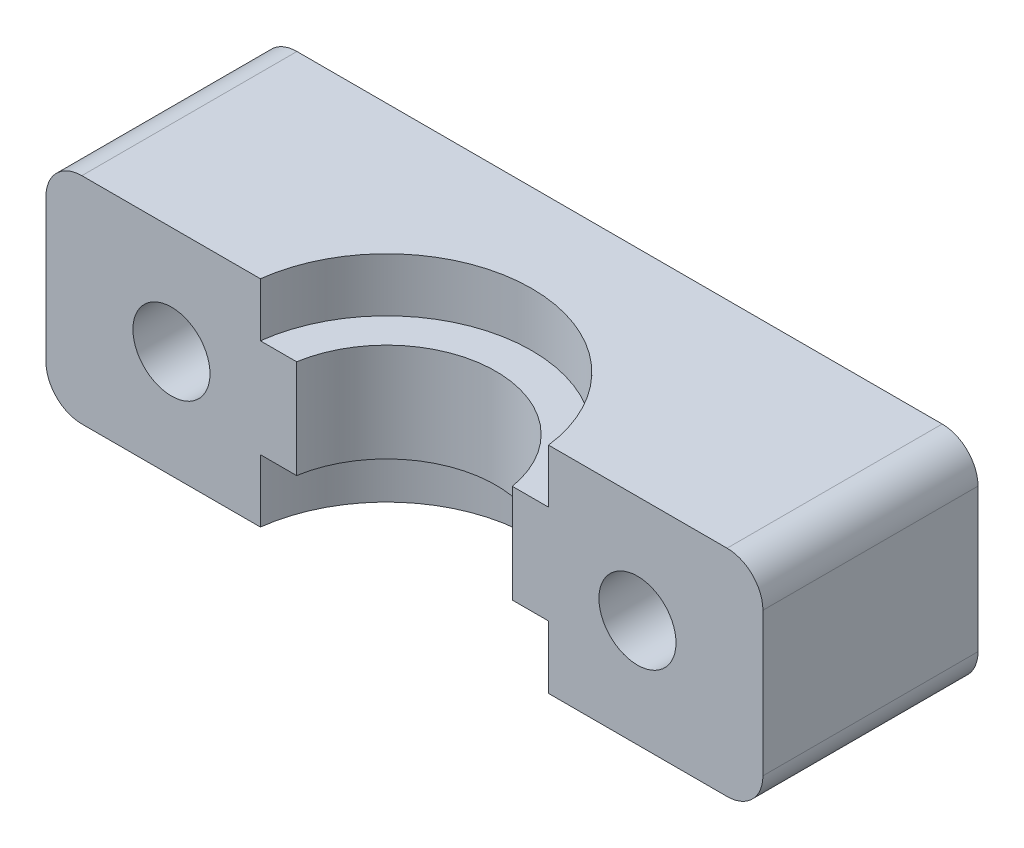
ISO-10303-21;
HEADER;
FILE_DESCRIPTION(('STEP AP214'),'2;1');
FILE_NAME('part.step','',(''),(''),'','','');
FILE_SCHEMA(('AUTOMOTIVE_DESIGN { 1 0 10303 214 1 1 1 1 }'));
ENDSEC;
DATA;
#1=APPLICATION_CONTEXT('core data for automotive mechanical design processes');
#2=APPLICATION_PROTOCOL_DEFINITION('international standard','automotive_design',2000,#1);
#3=PRODUCT_CONTEXT('',#1,'mechanical');
#4=PRODUCT('Part','Part','',(#3));
#5=PRODUCT_RELATED_PRODUCT_CATEGORY('part','',(#4));
#6=PRODUCT_DEFINITION_FORMATION('','',#4);
#7=PRODUCT_DEFINITION_CONTEXT('part definition',#1,'design');
#8=PRODUCT_DEFINITION('design','',#6,#7);
#9=PRODUCT_DEFINITION_SHAPE('','',#8);
#10=(LENGTH_UNIT() NAMED_UNIT(*) SI_UNIT(.MILLI.,.METRE.));
#11=(NAMED_UNIT(*) PLANE_ANGLE_UNIT() SI_UNIT($,.RADIAN.));
#12=(NAMED_UNIT(*) SI_UNIT($,.STERADIAN.) SOLID_ANGLE_UNIT());
#13=UNCERTAINTY_MEASURE_WITH_UNIT(LENGTH_MEASURE(1.E-05),#10,'distance_accuracy_value','');
#14=(GEOMETRIC_REPRESENTATION_CONTEXT(3) GLOBAL_UNCERTAINTY_ASSIGNED_CONTEXT((#13)) GLOBAL_UNIT_ASSIGNED_CONTEXT((#10,
#11,#12)) REPRESENTATION_CONTEXT('',''));
#15=CARTESIAN_POINT('',(0.,0.,0.));
#16=DIRECTION('',(0.,0.,1.));
#17=DIRECTION('',(1.,0.,0.));
#18=AXIS2_PLACEMENT_3D('',#15,#16,#17);
#19=CARTESIAN_POINT('',(13.,0.,12.));
#20=DIRECTION('',(0.,0.,1.));
#21=DIRECTION('',(-1.,0.,0.));
#22=AXIS2_PLACEMENT_3D('',#19,#20,#21);
#23=CYLINDRICAL_SURFACE('',#22,2.15);
#24=CARTESIAN_POINT('',(13.,0.,12.));
#25=DIRECTION('',(0.,0.,1.));
#26=DIRECTION('',(1.,0.,0.));
#27=AXIS2_PLACEMENT_3D('',#24,#25,#26);
#28=CIRCLE('',#27,2.15);
#29=CARTESIAN_POINT('',(15.15,0.,12.));
#30=VERTEX_POINT('',#29);
#31=EDGE_CURVE('E11',#30,#30,#28,.T.);
#32=ORIENTED_EDGE('',*,*,#31,.T.);
#33=EDGE_LOOP('',(#32));
#34=FACE_BOUND('',#33,.T.);
#35=CARTESIAN_POINT('',(13.,0.,5.2));
#36=DIRECTION('',(0.,0.,-1.));
#37=DIRECTION('',(-1.,0.,0.));
#38=AXIS2_PLACEMENT_3D('',#35,#36,#37);
#39=CIRCLE('',#38,2.15);
#40=CARTESIAN_POINT('',(10.85,0.,5.2));
#41=VERTEX_POINT('',#40);
#42=EDGE_CURVE('E277',#41,#41,#39,.T.);
#43=ORIENTED_EDGE('',*,*,#42,.T.);
#44=EDGE_LOOP('',(#43));
#45=FACE_BOUND('',#44,.T.);
#46=ADVANCED_FACE('F36',(#34,#45),#23,.F.);
#47=CARTESIAN_POINT('',(-13.,0.,12.));
#48=DIRECTION('',(0.,0.,1.));
#49=DIRECTION('',(-1.,0.,0.));
#50=AXIS2_PLACEMENT_3D('',#47,#48,#49);
#51=CYLINDRICAL_SURFACE('',#50,2.15);
#52=CARTESIAN_POINT('',(-13.,0.,12.));
#53=DIRECTION('',(0.,0.,1.));
#54=DIRECTION('',(1.,0.,0.));
#55=AXIS2_PLACEMENT_3D('',#52,#53,#54);
#56=CIRCLE('',#55,2.15);
#57=CARTESIAN_POINT('',(-10.85,0.,12.));
#58=VERTEX_POINT('',#57);
#59=EDGE_CURVE('E46',#58,#58,#56,.T.);
#60=ORIENTED_EDGE('',*,*,#59,.T.);
#61=EDGE_LOOP('',(#60));
#62=FACE_BOUND('',#61,.T.);
#63=CARTESIAN_POINT('',(-13.,0.,5.2));
#64=DIRECTION('',(0.,0.,-1.));
#65=DIRECTION('',(-1.,0.,0.));
#66=AXIS2_PLACEMENT_3D('',#63,#64,#65);
#67=CIRCLE('',#66,2.15);
#68=CARTESIAN_POINT('',(-15.15,0.,5.2));
#69=VERTEX_POINT('',#68);
#70=EDGE_CURVE('E279',#69,#69,#67,.T.);
#71=ORIENTED_EDGE('',*,*,#70,.T.);
#72=EDGE_LOOP('',(#71));
#73=FACE_BOUND('',#72,.T.);
#74=ADVANCED_FACE('F286',(#62,#73),#51,.F.);
#75=CARTESIAN_POINT('',(-18.,4.,12.));
#76=DIRECTION('',(0.,0.,-1.));
#77=DIRECTION('',(1.,0.,0.));
#78=AXIS2_PLACEMENT_3D('',#75,#76,#77);
#79=CYLINDRICAL_SURFACE('',#78,2.);
#80=CARTESIAN_POINT('',(-18.,4.,12.));
#81=DIRECTION('',(0.,0.,1.));
#82=DIRECTION('',(1.,0.,0.));
#83=AXIS2_PLACEMENT_3D('',#80,#81,#82);
#84=CIRCLE('',#83,2.);
#85=CARTESIAN_POINT('',(-18.,6.,12.));
#86=VERTEX_POINT('',#85);
#87=CARTESIAN_POINT('',(-20.,4.,12.));
#88=VERTEX_POINT('',#87);
#89=EDGE_CURVE('E55',#86,#88,#84,.T.);
#90=ORIENTED_EDGE('',*,*,#89,.F.);
#91=DIRECTION('',(0.,0.,1.));
#92=VECTOR('',#91,1.);
#93=CARTESIAN_POINT('',(-18.,6.,12.));
#94=LINE('',#93,#92);
#95=CARTESIAN_POINT('',(-18.,6.,0.));
#96=VERTEX_POINT('',#95);
#97=EDGE_CURVE('E156',#96,#86,#94,.T.);
#98=ORIENTED_EDGE('',*,*,#97,.F.);
#99=CARTESIAN_POINT('',(-18.,4.,0.));
#100=DIRECTION('',(0.,0.,-1.));
#101=DIRECTION('',(1.,0.,0.));
#102=AXIS2_PLACEMENT_3D('',#99,#100,#101);
#103=CIRCLE('',#102,2.);
#104=CARTESIAN_POINT('',(-20.,4.,0.));
#105=VERTEX_POINT('',#104);
#106=EDGE_CURVE('E163',#105,#96,#103,.T.);
#107=ORIENTED_EDGE('',*,*,#106,.F.);
#108=DIRECTION('',(0.,0.,-1.));
#109=VECTOR('',#108,1.);
#110=CARTESIAN_POINT('',(-20.,4.,0.));
#111=LINE('',#110,#109);
#112=EDGE_CURVE('E169',#88,#105,#111,.T.);
#113=ORIENTED_EDGE('',*,*,#112,.F.);
#114=EDGE_LOOP('',(#90,#98,#107,#113));
#115=FACE_BOUND('',#114,.T.);
#116=ADVANCED_FACE('F313',(#115),#79,.T.);
#117=CARTESIAN_POINT('',(-18.,-4.,12.));
#118=DIRECTION('',(0.,0.,1.));
#119=DIRECTION('',(-1.,0.,0.));
#120=AXIS2_PLACEMENT_3D('',#117,#118,#119);
#121=CYLINDRICAL_SURFACE('',#120,2.);
#122=CARTESIAN_POINT('',(-18.,-4.,12.));
#123=DIRECTION('',(0.,0.,1.));
#124=DIRECTION('',(1.,0.,0.));
#125=AXIS2_PLACEMENT_3D('',#122,#123,#124);
#126=CIRCLE('',#125,2.);
#127=CARTESIAN_POINT('',(-20.,-4.,12.));
#128=VERTEX_POINT('',#127);
#129=CARTESIAN_POINT('',(-18.,-6.,12.));
#130=VERTEX_POINT('',#129);
#131=EDGE_CURVE('E245',#128,#130,#126,.T.);
#132=ORIENTED_EDGE('',*,*,#131,.F.);
#133=DIRECTION('',(0.,0.,1.));
#134=VECTOR('',#133,1.);
#135=CARTESIAN_POINT('',(-20.,-4.,12.));
#136=LINE('',#135,#134);
#137=CARTESIAN_POINT('',(-20.,-4.,0.));
#138=VERTEX_POINT('',#137);
#139=EDGE_CURVE('E176',#138,#128,#136,.T.);
#140=ORIENTED_EDGE('',*,*,#139,.F.);
#141=CARTESIAN_POINT('',(-18.,-4.,0.));
#142=DIRECTION('',(0.,0.,-1.));
#143=DIRECTION('',(1.,0.,0.));
#144=AXIS2_PLACEMENT_3D('',#141,#142,#143);
#145=CIRCLE('',#144,2.);
#146=CARTESIAN_POINT('',(-18.,-6.,0.));
#147=VERTEX_POINT('',#146);
#148=EDGE_CURVE('E164',#147,#138,#145,.T.);
#149=ORIENTED_EDGE('',*,*,#148,.F.);
#150=DIRECTION('',(0.,0.,-1.));
#151=VECTOR('',#150,1.);
#152=CARTESIAN_POINT('',(-18.,-6.,12.));
#153=LINE('',#152,#151);
#154=EDGE_CURVE('E200',#130,#147,#153,.T.);
#155=ORIENTED_EDGE('',*,*,#154,.F.);
#156=EDGE_LOOP('',(#132,#140,#149,#155));
#157=FACE_BOUND('',#156,.T.);
#158=ADVANCED_FACE('F334',(#157),#121,.T.);
#159=CARTESIAN_POINT('',(18.,-4.,12.));
#160=DIRECTION('',(0.,0.,-1.));
#161=DIRECTION('',(1.,0.,0.));
#162=AXIS2_PLACEMENT_3D('',#159,#160,#161);
#163=CYLINDRICAL_SURFACE('',#162,2.);
#164=CARTESIAN_POINT('',(18.,-4.,12.));
#165=DIRECTION('',(0.,0.,1.));
#166=DIRECTION('',(1.,0.,0.));
#167=AXIS2_PLACEMENT_3D('',#164,#165,#166);
#168=CIRCLE('',#167,2.);
#169=CARTESIAN_POINT('',(18.,-6.,12.));
#170=VERTEX_POINT('',#169);
#171=CARTESIAN_POINT('',(20.,-4.,12.));
#172=VERTEX_POINT('',#171);
#173=EDGE_CURVE('E195',#170,#172,#168,.T.);
#174=ORIENTED_EDGE('',*,*,#173,.F.);
#175=DIRECTION('',(0.,0.,1.));
#176=VECTOR('',#175,1.);
#177=CARTESIAN_POINT('',(18.,-6.,12.));
#178=LINE('',#177,#176);
#179=CARTESIAN_POINT('',(18.,-6.,0.));
#180=VERTEX_POINT('',#179);
#181=EDGE_CURVE('E172',#180,#170,#178,.T.);
#182=ORIENTED_EDGE('',*,*,#181,.F.);
#183=CARTESIAN_POINT('',(18.,-4.,0.));
#184=DIRECTION('',(0.,0.,-1.));
#185=DIRECTION('',(1.,0.,0.));
#186=AXIS2_PLACEMENT_3D('',#183,#184,#185);
#187=CIRCLE('',#186,2.);
#188=CARTESIAN_POINT('',(20.,-4.,0.));
#189=VERTEX_POINT('',#188);
#190=EDGE_CURVE('E167',#189,#180,#187,.T.);
#191=ORIENTED_EDGE('',*,*,#190,.F.);
#192=DIRECTION('',(0.,0.,-1.));
#193=VECTOR('',#192,1.);
#194=CARTESIAN_POINT('',(20.,-4.,0.));
#195=LINE('',#194,#193);
#196=EDGE_CURVE('E202',#172,#189,#195,.T.);
#197=ORIENTED_EDGE('',*,*,#196,.F.);
#198=EDGE_LOOP('',(#174,#182,#191,#197));
#199=FACE_BOUND('',#198,.T.);
#200=ADVANCED_FACE('F337',(#199),#163,.T.);
#201=CARTESIAN_POINT('',(18.,4.,12.));
#202=DIRECTION('',(0.,0.,1.));
#203=DIRECTION('',(-1.,0.,0.));
#204=AXIS2_PLACEMENT_3D('',#201,#202,#203);
#205=CYLINDRICAL_SURFACE('',#204,2.);
#206=CARTESIAN_POINT('',(18.,4.,12.));
#207=DIRECTION('',(0.,0.,1.));
#208=DIRECTION('',(1.,0.,0.));
#209=AXIS2_PLACEMENT_3D('',#206,#207,#208);
#210=CIRCLE('',#209,2.);
#211=CARTESIAN_POINT('',(20.,4.,12.));
#212=VERTEX_POINT('',#211);
#213=CARTESIAN_POINT('',(18.,6.,12.));
#214=VERTEX_POINT('',#213);
#215=EDGE_CURVE('E204',#212,#214,#210,.T.);
#216=ORIENTED_EDGE('',*,*,#215,.F.);
#217=DIRECTION('',(0.,0.,1.));
#218=VECTOR('',#217,1.);
#219=CARTESIAN_POINT('',(20.,4.,12.));
#220=LINE('',#219,#218);
#221=CARTESIAN_POINT('',(20.,4.,0.));
#222=VERTEX_POINT('',#221);
#223=EDGE_CURVE('E221',#222,#212,#220,.T.);
#224=ORIENTED_EDGE('',*,*,#223,.F.);
#225=CARTESIAN_POINT('',(18.,4.,0.));
#226=DIRECTION('',(0.,0.,-1.));
#227=DIRECTION('',(1.,0.,0.));
#228=AXIS2_PLACEMENT_3D('',#225,#226,#227);
#229=CIRCLE('',#228,2.);
#230=CARTESIAN_POINT('',(18.,6.,0.));
#231=VERTEX_POINT('',#230);
#232=EDGE_CURVE('E40',#231,#222,#229,.T.);
#233=ORIENTED_EDGE('',*,*,#232,.F.);
#234=DIRECTION('',(0.,0.,-1.));
#235=VECTOR('',#234,1.);
#236=CARTESIAN_POINT('',(18.,6.,12.));
#237=LINE('',#236,#235);
#238=EDGE_CURVE('E177',#214,#231,#237,.T.);
#239=ORIENTED_EDGE('',*,*,#238,.F.);
#240=EDGE_LOOP('',(#216,#224,#233,#239));
#241=FACE_BOUND('',#240,.T.);
#242=ADVANCED_FACE('F335',(#241),#205,.T.);
#243=CARTESIAN_POINT('',(0.,3.,10.55));
#244=DIRECTION('',(0.,1.,0.));
#245=DIRECTION('',(1.,0.,0.));
#246=AXIS2_PLACEMENT_3D('',#243,#244,#245);
#247=PLANE('',#246);
#248=DIRECTION('',(1.,0.,0.));
#249=VECTOR('',#248,1.);
#250=CARTESIAN_POINT('',(0.,3.,12.));
#251=LINE('',#250,#249);
#252=CARTESIAN_POINT('',(6.01747455333215,3.,12.));
#253=VERTEX_POINT('',#252);
#254=CARTESIAN_POINT('',(8.03803458564343,3.,12.));
#255=VERTEX_POINT('',#254);
#256=EDGE_CURVE('E248',#253,#255,#251,.T.);
#257=ORIENTED_EDGE('',*,*,#256,.T.);
#258=CARTESIAN_POINT('',(0.,3.,13.));
#259=DIRECTION('',(0.,1.,0.));
#260=DIRECTION('',(-1.,0.,0.));
#261=AXIS2_PLACEMENT_3D('',#258,#259,#260);
#262=CIRCLE('',#261,8.1);
#263=CARTESIAN_POINT('',(-8.03803458564343,3.,12.));
#264=VERTEX_POINT('',#263);
#265=EDGE_CURVE('E134',#255,#264,#262,.T.);
#266=ORIENTED_EDGE('',*,*,#265,.T.);
#267=DIRECTION('',(1.,0.,0.));
#268=VECTOR('',#267,1.);
#269=CARTESIAN_POINT('',(0.,3.,12.));
#270=LINE('',#269,#268);
#271=CARTESIAN_POINT('',(-6.01747455333215,3.,12.));
#272=VERTEX_POINT('',#271);
#273=EDGE_CURVE('E132',#264,#272,#270,.T.);
#274=ORIENTED_EDGE('',*,*,#273,.T.);
#275=CARTESIAN_POINT('',(0.,3.,13.));
#276=DIRECTION('',(0.,1.,0.));
#277=DIRECTION('',(0.,0.,1.));
#278=AXIS2_PLACEMENT_3D('',#275,#276,#277);
#279=CIRCLE('',#278,6.1);
#280=EDGE_CURVE('E118',#253,#272,#279,.T.);
#281=ORIENTED_EDGE('',*,*,#280,.F.);
#282=EDGE_LOOP('',(#257,#266,#274,#281));
#283=FACE_BOUND('',#282,.T.);
#284=ADVANCED_FACE('F133',(#283),#247,.T.);
#285=CARTESIAN_POINT('',(0.,3.,13.));
#286=DIRECTION('',(0.,-1.,0.));
#287=DIRECTION('',(0.,0.,1.));
#288=AXIS2_PLACEMENT_3D('',#285,#286,#287);
#289=CYLINDRICAL_SURFACE('',#288,8.1);
#290=CARTESIAN_POINT('',(0.,6.,13.));
#291=DIRECTION('',(0.,1.,0.));
#292=DIRECTION('',(-1.,0.,0.));
#293=AXIS2_PLACEMENT_3D('',#290,#291,#292);
#294=CIRCLE('',#293,8.1);
#295=CARTESIAN_POINT('',(8.03803458564343,6.,12.));
#296=VERTEX_POINT('',#295);
#297=CARTESIAN_POINT('',(-8.03803458564343,6.,12.));
#298=VERTEX_POINT('',#297);
#299=EDGE_CURVE('E137',#296,#298,#294,.T.);
#300=ORIENTED_EDGE('',*,*,#299,.T.);
#301=DIRECTION('',(0.,1.,0.));
#302=VECTOR('',#301,1.);
#303=CARTESIAN_POINT('',(-8.03803458564343,3.,12.));
#304=LINE('',#303,#302);
#305=EDGE_CURVE('E216',#264,#298,#304,.T.);
#306=ORIENTED_EDGE('',*,*,#305,.F.);
#307=ORIENTED_EDGE('',*,*,#265,.F.);
#308=DIRECTION('',(0.,1.,0.));
#309=VECTOR('',#308,1.);
#310=CARTESIAN_POINT('',(8.03803458564343,3.,12.));
#311=LINE('',#310,#309);
#312=EDGE_CURVE('E233',#255,#296,#311,.T.);
#313=ORIENTED_EDGE('',*,*,#312,.T.);
#314=EDGE_LOOP('',(#300,#306,#307,#313));
#315=FACE_BOUND('',#314,.T.);
#316=ADVANCED_FACE('F273',(#315),#289,.F.);
#317=CARTESIAN_POINT('',(0.,-2.5,10.55));
#318=DIRECTION('',(0.,-1.,0.));
#319=DIRECTION('',(0.,0.,-1.));
#320=AXIS2_PLACEMENT_3D('',#317,#318,#319);
#321=PLANE('',#320);
#322=DIRECTION('',(1.,0.,0.));
#323=VECTOR('',#322,1.);
#324=CARTESIAN_POINT('',(0.,-2.5,12.));
#325=LINE('',#324,#323);
#326=CARTESIAN_POINT('',(-8.03803458564343,-2.5,12.));
#327=VERTEX_POINT('',#326);
#328=CARTESIAN_POINT('',(-6.01747455333215,-2.5,12.));
#329=VERTEX_POINT('',#328);
#330=EDGE_CURVE('E145',#327,#329,#325,.T.);
#331=ORIENTED_EDGE('',*,*,#330,.F.);
#332=CARTESIAN_POINT('',(0.,-2.5,13.));
#333=DIRECTION('',(0.,-1.,0.));
#334=DIRECTION('',(1.,0.,0.));
#335=AXIS2_PLACEMENT_3D('',#332,#333,#334);
#336=CIRCLE('',#335,8.1);
#337=CARTESIAN_POINT('',(8.03803458564343,-2.5,12.));
#338=VERTEX_POINT('',#337);
#339=EDGE_CURVE('E236',#327,#338,#336,.T.);
#340=ORIENTED_EDGE('',*,*,#339,.T.);
#341=DIRECTION('',(1.,0.,0.));
#342=VECTOR('',#341,1.);
#343=CARTESIAN_POINT('',(0.,-2.5,12.));
#344=LINE('',#343,#342);
#345=CARTESIAN_POINT('',(6.01747455333215,-2.5,12.));
#346=VERTEX_POINT('',#345);
#347=EDGE_CURVE('E162',#346,#338,#344,.T.);
#348=ORIENTED_EDGE('',*,*,#347,.F.);
#349=CARTESIAN_POINT('',(0.,-2.5,13.));
#350=DIRECTION('',(0.,-1.,0.));
#351=DIRECTION('',(1.,0.,0.));
#352=AXIS2_PLACEMENT_3D('',#349,#350,#351);
#353=CIRCLE('',#352,6.1);
#354=EDGE_CURVE('E147',#329,#346,#353,.T.);
#355=ORIENTED_EDGE('',*,*,#354,.F.);
#356=EDGE_LOOP('',(#331,#340,#348,#355));
#357=FACE_BOUND('',#356,.T.);
#358=ADVANCED_FACE('F316',(#357),#321,.T.);
#359=CARTESIAN_POINT('',(0.,-2.5,13.));
#360=DIRECTION('',(0.,1.,0.));
#361=DIRECTION('',(0.,0.,-1.));
#362=AXIS2_PLACEMENT_3D('',#359,#360,#361);
#363=CYLINDRICAL_SURFACE('',#362,8.1);
#364=CARTESIAN_POINT('',(0.,-6.,13.));
#365=DIRECTION('',(0.,-1.,0.));
#366=DIRECTION('',(1.,0.,0.));
#367=AXIS2_PLACEMENT_3D('',#364,#365,#366);
#368=CIRCLE('',#367,8.1);
#369=CARTESIAN_POINT('',(-8.03803458564343,-6.,12.));
#370=VERTEX_POINT('',#369);
#371=CARTESIAN_POINT('',(8.03803458564343,-6.,12.));
#372=VERTEX_POINT('',#371);
#373=EDGE_CURVE('E239',#370,#372,#368,.T.);
#374=ORIENTED_EDGE('',*,*,#373,.T.);
#375=DIRECTION('',(0.,-1.,0.));
#376=VECTOR('',#375,1.);
#377=CARTESIAN_POINT('',(8.03803458564343,-2.5,12.));
#378=LINE('',#377,#376);
#379=EDGE_CURVE('E159',#338,#372,#378,.T.);
#380=ORIENTED_EDGE('',*,*,#379,.F.);
#381=ORIENTED_EDGE('',*,*,#339,.F.);
#382=DIRECTION('',(0.,-1.,0.));
#383=VECTOR('',#382,1.);
#384=CARTESIAN_POINT('',(-8.03803458564343,-2.5,12.));
#385=LINE('',#384,#383);
#386=EDGE_CURVE('E129',#327,#370,#385,.T.);
#387=ORIENTED_EDGE('',*,*,#386,.T.);
#388=EDGE_LOOP('',(#374,#380,#381,#387));
#389=FACE_BOUND('',#388,.T.);
#390=ADVANCED_FACE('F319',(#389),#363,.F.);
#391=CARTESIAN_POINT('',(0.,37.4611219648009,13.));
#392=DIRECTION('',(0.,1.,0.));
#393=DIRECTION('',(0.,0.,-1.));
#394=AXIS2_PLACEMENT_3D('',#391,#392,#393);
#395=CYLINDRICAL_SURFACE('',#394,6.1);
#396=DIRECTION('',(0.,-1.,0.));
#397=VECTOR('',#396,1.);
#398=CARTESIAN_POINT('',(6.01747455333215,37.4611219648009,12.));
#399=LINE('',#398,#397);
#400=EDGE_CURVE('E125',#253,#346,#399,.T.);
#401=ORIENTED_EDGE('',*,*,#400,.F.);
#402=ORIENTED_EDGE('',*,*,#280,.T.);
#403=DIRECTION('',(0.,-1.,0.));
#404=VECTOR('',#403,1.);
#405=CARTESIAN_POINT('',(-6.01747455333215,37.4611219648009,12.));
#406=LINE('',#405,#404);
#407=EDGE_CURVE('E123',#272,#329,#406,.T.);
#408=ORIENTED_EDGE('',*,*,#407,.T.);
#409=ORIENTED_EDGE('',*,*,#354,.T.);
#410=EDGE_LOOP('',(#401,#402,#408,#409));
#411=FACE_BOUND('',#410,.T.);
#412=ADVANCED_FACE('F120',(#411),#395,.F.);
#413=CARTESIAN_POINT('',(0.,0.,5.2));
#414=DIRECTION('',(0.,0.,-1.));
#415=DIRECTION('',(0.,-1.,0.));
#416=AXIS2_PLACEMENT_3D('',#413,#414,#415);
#417=PLANE('',#416);
#418=ORIENTED_EDGE('',*,*,#70,.F.);
#419=EDGE_LOOP('',(#418));
#420=FACE_BOUND('',#419,.T.);
#421=CARTESIAN_POINT('',(-13.,0.,5.2));
#422=DIRECTION('',(0.,0.,-1.));
#423=DIRECTION('',(1.,0.,0.));
#424=AXIS2_PLACEMENT_3D('',#421,#422,#423);
#425=CIRCLE('',#424,3.75);
#426=CARTESIAN_POINT('',(-9.25,0.,5.2));
#427=VERTEX_POINT('',#426);
#428=EDGE_CURVE('E149',#427,#427,#425,.T.);
#429=ORIENTED_EDGE('',*,*,#428,.T.);
#430=EDGE_LOOP('',(#429));
#431=FACE_BOUND('',#430,.T.);
#432=ADVANCED_FACE('F288',(#420,#431),#417,.T.);
#433=CARTESIAN_POINT('',(-13.,0.,5.2));
#434=DIRECTION('',(0.,0.,1.));
#435=DIRECTION('',(-1.,0.,0.));
#436=AXIS2_PLACEMENT_3D('',#433,#434,#435);
#437=CYLINDRICAL_SURFACE('',#436,3.75);
#438=CARTESIAN_POINT('',(-13.,0.,0.));
#439=DIRECTION('',(0.,0.,-1.));
#440=DIRECTION('',(1.,0.,0.));
#441=AXIS2_PLACEMENT_3D('',#438,#439,#440);
#442=CIRCLE('',#441,3.75);
#443=CARTESIAN_POINT('',(-9.25,0.,0.));
#444=VERTEX_POINT('',#443);
#445=EDGE_CURVE('E227',#444,#444,#442,.T.);
#446=ORIENTED_EDGE('',*,*,#445,.T.);
#447=EDGE_LOOP('',(#446));
#448=FACE_BOUND('',#447,.T.);
#449=ORIENTED_EDGE('',*,*,#428,.F.);
#450=EDGE_LOOP('',(#449));
#451=FACE_BOUND('',#450,.T.);
#452=ADVANCED_FACE('F291',(#448,#451),#437,.F.);
#453=CARTESIAN_POINT('',(0.,0.,5.2));
#454=DIRECTION('',(0.,0.,-1.));
#455=DIRECTION('',(0.,-1.,0.));
#456=AXIS2_PLACEMENT_3D('',#453,#454,#455);
#457=PLANE('',#456);
#458=ORIENTED_EDGE('',*,*,#42,.F.);
#459=EDGE_LOOP('',(#458));
#460=FACE_BOUND('',#459,.T.);
#461=CARTESIAN_POINT('',(13.,0.,5.2));
#462=DIRECTION('',(0.,0.,-1.));
#463=DIRECTION('',(1.,0.,0.));
#464=AXIS2_PLACEMENT_3D('',#461,#462,#463);
#465=CIRCLE('',#464,3.75);
#466=CARTESIAN_POINT('',(16.75,0.,5.2));
#467=VERTEX_POINT('',#466);
#468=EDGE_CURVE('E230',#467,#467,#465,.T.);
#469=ORIENTED_EDGE('',*,*,#468,.T.);
#470=EDGE_LOOP('',(#469));
#471=FACE_BOUND('',#470,.T.);
#472=ADVANCED_FACE('F296',(#460,#471),#457,.T.);
#473=CARTESIAN_POINT('',(13.,0.,5.2));
#474=DIRECTION('',(0.,0.,1.));
#475=DIRECTION('',(-1.,0.,0.));
#476=AXIS2_PLACEMENT_3D('',#473,#474,#475);
#477=CYLINDRICAL_SURFACE('',#476,3.75);
#478=CARTESIAN_POINT('',(13.,0.,0.));
#479=DIRECTION('',(0.,0.,-1.));
#480=DIRECTION('',(1.,0.,0.));
#481=AXIS2_PLACEMENT_3D('',#478,#479,#480);
#482=CIRCLE('',#481,3.75);
#483=CARTESIAN_POINT('',(16.75,0.,0.));
#484=VERTEX_POINT('',#483);
#485=EDGE_CURVE('E194',#484,#484,#482,.T.);
#486=ORIENTED_EDGE('',*,*,#485,.T.);
#487=EDGE_LOOP('',(#486));
#488=FACE_BOUND('',#487,.T.);
#489=ORIENTED_EDGE('',*,*,#468,.F.);
#490=EDGE_LOOP('',(#489));
#491=FACE_BOUND('',#490,.T.);
#492=ADVANCED_FACE('F302',(#488,#491),#477,.F.);
#493=CARTESIAN_POINT('',(0.,0.,12.));
#494=DIRECTION('',(0.,0.,1.));
#495=DIRECTION('',(1.,0.,0.));
#496=AXIS2_PLACEMENT_3D('',#493,#494,#495);
#497=PLANE('',#496);
#498=DIRECTION('',(1.,0.,0.));
#499=VECTOR('',#498,1.);
#500=CARTESIAN_POINT('',(0.,-6.,12.));
#501=LINE('',#500,#499);
#502=EDGE_CURVE('E191',#372,#170,#501,.T.);
#503=ORIENTED_EDGE('',*,*,#502,.T.);
#504=ORIENTED_EDGE('',*,*,#173,.T.);
#505=DIRECTION('',(0.,-1.,0.));
#506=VECTOR('',#505,1.);
#507=CARTESIAN_POINT('',(20.,0.,12.));
#508=LINE('',#507,#506);
#509=EDGE_CURVE('E168',#212,#172,#508,.T.);
#510=ORIENTED_EDGE('',*,*,#509,.F.);
#511=ORIENTED_EDGE('',*,*,#215,.T.);
#512=DIRECTION('',(1.,0.,0.));
#513=VECTOR('',#512,1.);
#514=CARTESIAN_POINT('',(0.,6.,12.));
#515=LINE('',#514,#513);
#516=EDGE_CURVE('E157',#296,#214,#515,.T.);
#517=ORIENTED_EDGE('',*,*,#516,.F.);
#518=ORIENTED_EDGE('',*,*,#312,.F.);
#519=ORIENTED_EDGE('',*,*,#256,.F.);
#520=ORIENTED_EDGE('',*,*,#400,.T.);
#521=ORIENTED_EDGE('',*,*,#347,.T.);
#522=ORIENTED_EDGE('',*,*,#379,.T.);
#523=EDGE_LOOP('',(#503,#504,#510,#511,#517,#518,#519,#520,#521,#522));
#524=FACE_BOUND('',#523,.T.);
#525=ORIENTED_EDGE('',*,*,#31,.F.);
#526=EDGE_LOOP('',(#525));
#527=FACE_BOUND('',#526,.T.);
#528=ADVANCED_FACE('F269',(#524,#527),#497,.T.);
#529=CARTESIAN_POINT('',(0.,0.,0.));
#530=DIRECTION('',(0.,0.,1.));
#531=DIRECTION('',(1.,0.,0.));
#532=AXIS2_PLACEMENT_3D('',#529,#530,#531);
#533=PLANE('',#532);
#534=DIRECTION('',(0.,-1.,0.));
#535=VECTOR('',#534,1.);
#536=CARTESIAN_POINT('',(-20.,0.,0.));
#537=LINE('',#536,#535);
#538=EDGE_CURVE('E173',#105,#138,#537,.T.);
#539=ORIENTED_EDGE('',*,*,#538,.F.);
#540=ORIENTED_EDGE('',*,*,#106,.T.);
#541=DIRECTION('',(1.,0.,0.));
#542=VECTOR('',#541,1.);
#543=CARTESIAN_POINT('',(0.,6.,0.));
#544=LINE('',#543,#542);
#545=EDGE_CURVE('E180',#96,#231,#544,.T.);
#546=ORIENTED_EDGE('',*,*,#545,.T.);
#547=ORIENTED_EDGE('',*,*,#232,.T.);
#548=DIRECTION('',(0.,-1.,0.));
#549=VECTOR('',#548,1.);
#550=CARTESIAN_POINT('',(20.,0.,0.));
#551=LINE('',#550,#549);
#552=EDGE_CURVE('E188',#222,#189,#551,.T.);
#553=ORIENTED_EDGE('',*,*,#552,.T.);
#554=ORIENTED_EDGE('',*,*,#190,.T.);
#555=DIRECTION('',(1.,0.,0.));
#556=VECTOR('',#555,1.);
#557=CARTESIAN_POINT('',(0.,-6.,0.));
#558=LINE('',#557,#556);
#559=EDGE_CURVE('E197',#147,#180,#558,.T.);
#560=ORIENTED_EDGE('',*,*,#559,.F.);
#561=ORIENTED_EDGE('',*,*,#148,.T.);
#562=EDGE_LOOP('',(#539,#540,#546,#547,#553,#554,#560,#561));
#563=FACE_BOUND('',#562,.T.);
#564=ORIENTED_EDGE('',*,*,#445,.F.);
#565=EDGE_LOOP('',(#564));
#566=FACE_BOUND('',#565,.T.);
#567=ORIENTED_EDGE('',*,*,#485,.F.);
#568=EDGE_LOOP('',(#567));
#569=FACE_BOUND('',#568,.T.);
#570=ADVANCED_FACE('F362',(#563,#566,#569),#533,.F.);
#571=CARTESIAN_POINT('',(20.,0.,12.));
#572=DIRECTION('',(1.,0.,0.));
#573=DIRECTION('',(0.,1.,0.));
#574=AXIS2_PLACEMENT_3D('',#571,#572,#573);
#575=PLANE('',#574);
#576=ORIENTED_EDGE('',*,*,#509,.T.);
#577=ORIENTED_EDGE('',*,*,#196,.T.);
#578=ORIENTED_EDGE('',*,*,#552,.F.);
#579=ORIENTED_EDGE('',*,*,#223,.T.);
#580=EDGE_LOOP('',(#576,#577,#578,#579));
#581=FACE_BOUND('',#580,.T.);
#582=ADVANCED_FACE('F38',(#581),#575,.T.);
#583=CARTESIAN_POINT('',(0.,-6.,12.));
#584=DIRECTION('',(0.,1.,0.));
#585=DIRECTION('',(1.,0.,0.));
#586=AXIS2_PLACEMENT_3D('',#583,#584,#585);
#587=PLANE('',#586);
#588=DIRECTION('',(1.,0.,0.));
#589=VECTOR('',#588,1.);
#590=CARTESIAN_POINT('',(0.,-6.,12.));
#591=LINE('',#590,#589);
#592=EDGE_CURVE('E243',#130,#370,#591,.T.);
#593=ORIENTED_EDGE('',*,*,#592,.F.);
#594=ORIENTED_EDGE('',*,*,#154,.T.);
#595=ORIENTED_EDGE('',*,*,#559,.T.);
#596=ORIENTED_EDGE('',*,*,#181,.T.);
#597=ORIENTED_EDGE('',*,*,#502,.F.);
#598=ORIENTED_EDGE('',*,*,#373,.F.);
#599=EDGE_LOOP('',(#593,#594,#595,#596,#597,#598));
#600=FACE_BOUND('',#599,.T.);
#601=ADVANCED_FACE('F381',(#600),#587,.F.);
#602=CARTESIAN_POINT('',(-20.,0.,12.));
#603=DIRECTION('',(1.,0.,0.));
#604=DIRECTION('',(0.,1.,0.));
#605=AXIS2_PLACEMENT_3D('',#602,#603,#604);
#606=PLANE('',#605);
#607=DIRECTION('',(0.,-1.,0.));
#608=VECTOR('',#607,1.);
#609=CARTESIAN_POINT('',(-20.,0.,12.));
#610=LINE('',#609,#608);
#611=EDGE_CURVE('E178',#88,#128,#610,.T.);
#612=ORIENTED_EDGE('',*,*,#611,.F.);
#613=ORIENTED_EDGE('',*,*,#112,.T.);
#614=ORIENTED_EDGE('',*,*,#538,.T.);
#615=ORIENTED_EDGE('',*,*,#139,.T.);
#616=EDGE_LOOP('',(#612,#613,#614,#615));
#617=FACE_BOUND('',#616,.T.);
#618=ADVANCED_FACE('F331',(#617),#606,.F.);
#619=CARTESIAN_POINT('',(0.,6.,12.));
#620=DIRECTION('',(0.,1.,0.));
#621=DIRECTION('',(1.,0.,0.));
#622=AXIS2_PLACEMENT_3D('',#619,#620,#621);
#623=PLANE('',#622);
#624=ORIENTED_EDGE('',*,*,#545,.F.);
#625=ORIENTED_EDGE('',*,*,#97,.T.);
#626=DIRECTION('',(1.,0.,0.));
#627=VECTOR('',#626,1.);
#628=CARTESIAN_POINT('',(0.,6.,12.));
#629=LINE('',#628,#627);
#630=EDGE_CURVE('E154',#86,#298,#629,.T.);
#631=ORIENTED_EDGE('',*,*,#630,.T.);
#632=ORIENTED_EDGE('',*,*,#299,.F.);
#633=ORIENTED_EDGE('',*,*,#516,.T.);
#634=ORIENTED_EDGE('',*,*,#238,.T.);
#635=EDGE_LOOP('',(#624,#625,#631,#632,#633,#634));
#636=FACE_BOUND('',#635,.T.);
#637=ADVANCED_FACE('F276',(#636),#623,.T.);
#638=CARTESIAN_POINT('',(0.,0.,12.));
#639=DIRECTION('',(0.,0.,1.));
#640=DIRECTION('',(1.,0.,0.));
#641=AXIS2_PLACEMENT_3D('',#638,#639,#640);
#642=PLANE('',#641);
#643=ORIENTED_EDGE('',*,*,#630,.F.);
#644=ORIENTED_EDGE('',*,*,#89,.T.);
#645=ORIENTED_EDGE('',*,*,#611,.T.);
#646=ORIENTED_EDGE('',*,*,#131,.T.);
#647=ORIENTED_EDGE('',*,*,#592,.T.);
#648=ORIENTED_EDGE('',*,*,#386,.F.);
#649=ORIENTED_EDGE('',*,*,#330,.T.);
#650=ORIENTED_EDGE('',*,*,#407,.F.);
#651=ORIENTED_EDGE('',*,*,#273,.F.);
#652=ORIENTED_EDGE('',*,*,#305,.T.);
#653=EDGE_LOOP('',(#643,#644,#645,#646,#647,#648,#649,#650,#651,#652));
#654=FACE_BOUND('',#653,.T.);
#655=ORIENTED_EDGE('',*,*,#59,.F.);
#656=EDGE_LOOP('',(#655));
#657=FACE_BOUND('',#656,.T.);
#658=ADVANCED_FACE('F141',(#654,#657),#642,.T.);
#659=CLOSED_SHELL('',(#46,#74,#116,#158,#200,#242,#284,#316,#358,#390,#412,#432,#452,#472,#492,
#528,#570,#582,#601,#618,#637,#658));
#660=MANIFOLD_SOLID_BREP('B2',#659);
#661=ADVANCED_BREP_SHAPE_REPRESENTATION('',(#18,#660),#14);
#662=SHAPE_DEFINITION_REPRESENTATION(#9,#661);
ENDSEC;
END-ISO-10303-21;
